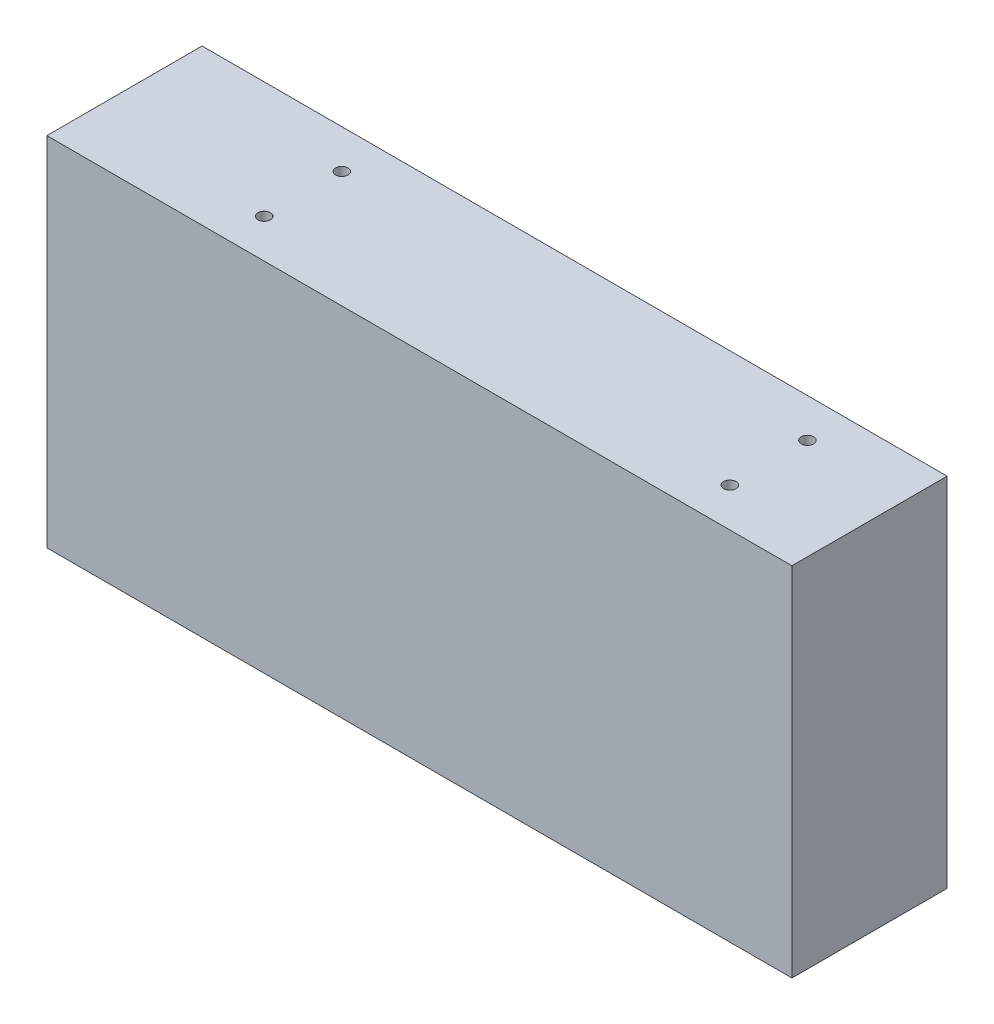
ISO-10303-21;
HEADER;
FILE_DESCRIPTION(('STEP AP214'),'2;1');
FILE_NAME('part.step','',(''),(''),'','','');
FILE_SCHEMA(('AUTOMOTIVE_DESIGN { 1 0 10303 214 1 1 1 1 }'));
ENDSEC;
DATA;
#1=APPLICATION_CONTEXT('core data for automotive mechanical design processes');
#2=APPLICATION_PROTOCOL_DEFINITION('international standard','automotive_design',2000,#1);
#3=PRODUCT_CONTEXT('',#1,'mechanical');
#4=PRODUCT('Part','Part','',(#3));
#5=PRODUCT_RELATED_PRODUCT_CATEGORY('part','',(#4));
#6=PRODUCT_DEFINITION_FORMATION('','',#4);
#7=PRODUCT_DEFINITION_CONTEXT('part definition',#1,'design');
#8=PRODUCT_DEFINITION('design','',#6,#7);
#9=PRODUCT_DEFINITION_SHAPE('','',#8);
#10=(LENGTH_UNIT() NAMED_UNIT(*) SI_UNIT(.MILLI.,.METRE.));
#11=(NAMED_UNIT(*) PLANE_ANGLE_UNIT() SI_UNIT($,.RADIAN.));
#12=(NAMED_UNIT(*) SI_UNIT($,.STERADIAN.) SOLID_ANGLE_UNIT());
#13=UNCERTAINTY_MEASURE_WITH_UNIT(LENGTH_MEASURE(1.E-05),#10,'distance_accuracy_value','');
#14=(GEOMETRIC_REPRESENTATION_CONTEXT(3) GLOBAL_UNCERTAINTY_ASSIGNED_CONTEXT((#13)) GLOBAL_UNIT_ASSIGNED_CONTEXT((#10,
#11,#12)) REPRESENTATION_CONTEXT('',''));
#15=CARTESIAN_POINT('',(0.,0.,0.));
#16=DIRECTION('',(0.,0.,1.));
#17=DIRECTION('',(1.,0.,0.));
#18=AXIS2_PLACEMENT_3D('',#15,#16,#17);
#19=CARTESIAN_POINT('',(-117.057220708447,61.7983651226158,50.));
#20=DIRECTION('',(1.,0.,0.));
#21=DIRECTION('',(0.,0.,-1.));
#22=AXIS2_PLACEMENT_3D('',#19,#20,#21);
#23=PLANE('',#22);
#24=DIRECTION('',(0.,-1.,0.));
#25=VECTOR('',#24,1.);
#26=CARTESIAN_POINT('',(-117.057220708447,61.7983651226158,0.));
#27=LINE('',#26,#25);
#28=CARTESIAN_POINT('',(-117.057220708447,61.7983651226158,0.));
#29=VERTEX_POINT('',#28);
#30=CARTESIAN_POINT('',(-117.057220708447,-53.2016348773842,0.));
#31=VERTEX_POINT('',#30);
#32=EDGE_CURVE('E109',#29,#31,#27,.T.);
#33=ORIENTED_EDGE('',*,*,#32,.T.);
#34=DIRECTION('',(0.,0.,-1.));
#35=VECTOR('',#34,1.);
#36=CARTESIAN_POINT('',(-117.057220708447,-53.2016348773842,50.));
#37=LINE('',#36,#35);
#38=CARTESIAN_POINT('',(-117.057220708447,-53.2016348773842,50.));
#39=VERTEX_POINT('',#38);
#40=EDGE_CURVE('E11',#39,#31,#37,.T.);
#41=ORIENTED_EDGE('',*,*,#40,.F.);
#42=DIRECTION('',(0.,-1.,0.));
#43=VECTOR('',#42,1.);
#44=CARTESIAN_POINT('',(-117.057220708447,61.7983651226158,50.));
#45=LINE('',#44,#43);
#46=CARTESIAN_POINT('',(-117.057220708447,61.7983651226158,50.));
#47=VERTEX_POINT('',#46);
#48=EDGE_CURVE('E93',#47,#39,#45,.T.);
#49=ORIENTED_EDGE('',*,*,#48,.F.);
#50=DIRECTION('',(0.,0.,-1.));
#51=VECTOR('',#50,1.);
#52=CARTESIAN_POINT('',(-117.057220708447,61.7983651226158,50.));
#53=LINE('',#52,#51);
#54=EDGE_CURVE('E105',#47,#29,#53,.T.);
#55=ORIENTED_EDGE('',*,*,#54,.T.);
#56=EDGE_LOOP('',(#33,#41,#49,#55));
#57=FACE_BOUND('',#56,.T.);
#58=ADVANCED_FACE('F41',(#57),#23,.F.);
#59=CARTESIAN_POINT('',(-117.057220708447,-53.2016348773842,50.));
#60=DIRECTION('',(0.,1.,0.));
#61=DIRECTION('',(0.,0.,1.));
#62=AXIS2_PLACEMENT_3D('',#59,#60,#61);
#63=PLANE('',#62);
#64=DIRECTION('',(1.,0.,0.));
#65=VECTOR('',#64,1.);
#66=CARTESIAN_POINT('',(-117.057220708447,-53.2016348773842,0.));
#67=LINE('',#66,#65);
#68=CARTESIAN_POINT('',(122.942779291553,-53.2016348773842,0.));
#69=VERTEX_POINT('',#68);
#70=EDGE_CURVE('E98',#31,#69,#67,.T.);
#71=ORIENTED_EDGE('',*,*,#70,.T.);
#72=DIRECTION('',(0.,0.,-1.));
#73=VECTOR('',#72,1.);
#74=CARTESIAN_POINT('',(122.942779291553,-53.2016348773842,50.));
#75=LINE('',#74,#73);
#76=CARTESIAN_POINT('',(122.942779291553,-53.2016348773842,50.));
#77=VERTEX_POINT('',#76);
#78=EDGE_CURVE('E50',#77,#69,#75,.T.);
#79=ORIENTED_EDGE('',*,*,#78,.F.);
#80=DIRECTION('',(1.,0.,0.));
#81=VECTOR('',#80,1.);
#82=CARTESIAN_POINT('',(-117.057220708447,-53.2016348773842,50.));
#83=LINE('',#82,#81);
#84=EDGE_CURVE('E88',#39,#77,#83,.T.);
#85=ORIENTED_EDGE('',*,*,#84,.F.);
#86=ORIENTED_EDGE('',*,*,#40,.T.);
#87=EDGE_LOOP('',(#71,#79,#85,#86));
#88=FACE_BOUND('',#87,.T.);
#89=ADVANCED_FACE('F97',(#88),#63,.F.);
#90=CARTESIAN_POINT('',(122.942779291553,61.7983651226158,50.));
#91=DIRECTION('',(-1.,0.,0.));
#92=DIRECTION('',(0.,0.,1.));
#93=AXIS2_PLACEMENT_3D('',#90,#91,#92);
#94=PLANE('',#93);
#95=DIRECTION('',(0.,1.,0.));
#96=VECTOR('',#95,1.);
#97=CARTESIAN_POINT('',(122.942779291553,61.7983651226158,0.));
#98=LINE('',#97,#96);
#99=CARTESIAN_POINT('',(122.942779291553,61.7983651226158,0.));
#100=VERTEX_POINT('',#99);
#101=EDGE_CURVE('E75',#69,#100,#98,.T.);
#102=ORIENTED_EDGE('',*,*,#101,.T.);
#103=DIRECTION('',(0.,0.,-1.));
#104=VECTOR('',#103,1.);
#105=CARTESIAN_POINT('',(122.942779291553,61.7983651226158,50.));
#106=LINE('',#105,#104);
#107=CARTESIAN_POINT('',(122.942779291553,61.7983651226158,50.));
#108=VERTEX_POINT('',#107);
#109=EDGE_CURVE('E100',#108,#100,#106,.T.);
#110=ORIENTED_EDGE('',*,*,#109,.F.);
#111=DIRECTION('',(0.,1.,0.));
#112=VECTOR('',#111,1.);
#113=CARTESIAN_POINT('',(122.942779291553,61.7983651226158,50.));
#114=LINE('',#113,#112);
#115=EDGE_CURVE('E91',#77,#108,#114,.T.);
#116=ORIENTED_EDGE('',*,*,#115,.F.);
#117=ORIENTED_EDGE('',*,*,#78,.T.);
#118=EDGE_LOOP('',(#102,#110,#116,#117));
#119=FACE_BOUND('',#118,.T.);
#120=ADVANCED_FACE('F101',(#119),#94,.F.);
#121=CARTESIAN_POINT('',(-117.057220708447,61.7983651226158,50.));
#122=DIRECTION('',(0.,-1.,0.));
#123=DIRECTION('',(0.,0.,-1.));
#124=AXIS2_PLACEMENT_3D('',#121,#122,#123);
#125=PLANE('',#124);
#126=CARTESIAN_POINT('',(90.4427792915531,61.7983651226158,12.5));
#127=DIRECTION('',(0.,1.,0.));
#128=DIRECTION('',(0.,0.,1.));
#129=AXIS2_PLACEMENT_3D('',#126,#127,#128);
#130=CIRCLE('',#129,2.);
#131=CARTESIAN_POINT('',(90.4427792915531,61.7983651226158,14.5));
#132=VERTEX_POINT('',#131);
#133=EDGE_CURVE('E170',#132,#132,#130,.T.);
#134=ORIENTED_EDGE('',*,*,#133,.F.);
#135=EDGE_LOOP('',(#134));
#136=FACE_BOUND('',#135,.T.);
#137=CARTESIAN_POINT('',(-59.5572207084468,61.7983651226158,12.5));
#138=DIRECTION('',(0.,1.,0.));
#139=DIRECTION('',(0.,0.,1.));
#140=AXIS2_PLACEMENT_3D('',#137,#138,#139);
#141=CIRCLE('',#140,2.);
#142=CARTESIAN_POINT('',(-59.5572207084468,61.7983651226158,14.5));
#143=VERTEX_POINT('',#142);
#144=EDGE_CURVE('E178',#143,#143,#141,.T.);
#145=ORIENTED_EDGE('',*,*,#144,.F.);
#146=EDGE_LOOP('',(#145));
#147=FACE_BOUND('',#146,.T.);
#148=CARTESIAN_POINT('',(-59.5572207084468,61.7983651226158,37.5));
#149=DIRECTION('',(0.,1.,0.));
#150=DIRECTION('',(0.,0.,1.));
#151=AXIS2_PLACEMENT_3D('',#148,#149,#150);
#152=CIRCLE('',#151,2.);
#153=CARTESIAN_POINT('',(-59.5572207084468,61.7983651226158,39.5));
#154=VERTEX_POINT('',#153);
#155=EDGE_CURVE('E186',#154,#154,#152,.T.);
#156=ORIENTED_EDGE('',*,*,#155,.F.);
#157=EDGE_LOOP('',(#156));
#158=FACE_BOUND('',#157,.T.);
#159=CARTESIAN_POINT('',(90.4427792915532,61.7983651226158,37.5));
#160=DIRECTION('',(0.,1.,0.));
#161=DIRECTION('',(0.,0.,1.));
#162=AXIS2_PLACEMENT_3D('',#159,#160,#161);
#163=CIRCLE('',#162,2.);
#164=CARTESIAN_POINT('',(90.4427792915532,61.7983651226158,39.5));
#165=VERTEX_POINT('',#164);
#166=EDGE_CURVE('E162',#165,#165,#163,.T.);
#167=ORIENTED_EDGE('',*,*,#166,.F.);
#168=EDGE_LOOP('',(#167));
#169=FACE_BOUND('',#168,.T.);
#170=DIRECTION('',(-1.,0.,0.));
#171=VECTOR('',#170,1.);
#172=CARTESIAN_POINT('',(-117.057220708447,61.7983651226158,0.));
#173=LINE('',#172,#171);
#174=EDGE_CURVE('E81',#100,#29,#173,.T.);
#175=ORIENTED_EDGE('',*,*,#174,.T.);
#176=ORIENTED_EDGE('',*,*,#54,.F.);
#177=DIRECTION('',(-1.,0.,0.));
#178=VECTOR('',#177,1.);
#179=CARTESIAN_POINT('',(-117.057220708447,61.7983651226158,50.));
#180=LINE('',#179,#178);
#181=EDGE_CURVE('E58',#108,#47,#180,.T.);
#182=ORIENTED_EDGE('',*,*,#181,.F.);
#183=ORIENTED_EDGE('',*,*,#109,.T.);
#184=EDGE_LOOP('',(#175,#176,#182,#183));
#185=FACE_BOUND('',#184,.T.);
#186=ADVANCED_FACE('F123',(#136,#147,#158,#169,#185),#125,.F.);
#187=CARTESIAN_POINT('',(0.,0.,50.));
#188=DIRECTION('',(0.,0.,1.));
#189=DIRECTION('',(1.,0.,0.));
#190=AXIS2_PLACEMENT_3D('',#187,#188,#189);
#191=PLANE('',#190);
#192=ORIENTED_EDGE('',*,*,#48,.T.);
#193=ORIENTED_EDGE('',*,*,#84,.T.);
#194=ORIENTED_EDGE('',*,*,#115,.T.);
#195=ORIENTED_EDGE('',*,*,#181,.T.);
#196=EDGE_LOOP('',(#192,#193,#194,#195));
#197=FACE_BOUND('',#196,.T.);
#198=ADVANCED_FACE('F89',(#197),#191,.T.);
#199=CARTESIAN_POINT('',(0.,0.,0.));
#200=DIRECTION('',(0.,0.,1.));
#201=DIRECTION('',(1.,0.,0.));
#202=AXIS2_PLACEMENT_3D('',#199,#200,#201);
#203=PLANE('',#202);
#204=CARTESIAN_POINT('',(90.4427792915531,-20.7016348773842,0.));
#205=DIRECTION('',(0.,0.,-1.));
#206=DIRECTION('',(-1.,0.,0.));
#207=AXIS2_PLACEMENT_3D('',#204,#205,#206);
#208=CIRCLE('',#207,2.);
#209=CARTESIAN_POINT('',(88.4427792915531,-20.7016348773842,0.));
#210=VERTEX_POINT('',#209);
#211=EDGE_CURVE('E138',#210,#210,#208,.T.);
#212=ORIENTED_EDGE('',*,*,#211,.F.);
#213=EDGE_LOOP('',(#212));
#214=FACE_BOUND('',#213,.T.);
#215=CARTESIAN_POINT('',(-59.5572207084468,-20.7016348773842,0.));
#216=DIRECTION('',(0.,0.,-1.));
#217=DIRECTION('',(-1.,0.,0.));
#218=AXIS2_PLACEMENT_3D('',#215,#216,#217);
#219=CIRCLE('',#218,2.);
#220=CARTESIAN_POINT('',(-61.5572207084469,-20.7016348773842,0.));
#221=VERTEX_POINT('',#220);
#222=EDGE_CURVE('E147',#221,#221,#219,.T.);
#223=ORIENTED_EDGE('',*,*,#222,.F.);
#224=EDGE_LOOP('',(#223));
#225=FACE_BOUND('',#224,.T.);
#226=CARTESIAN_POINT('',(-59.5572207084468,29.2983651226158,0.));
#227=DIRECTION('',(0.,0.,-1.));
#228=DIRECTION('',(-1.,0.,0.));
#229=AXIS2_PLACEMENT_3D('',#226,#227,#228);
#230=CIRCLE('',#229,2.);
#231=CARTESIAN_POINT('',(-61.5572207084468,29.2983651226158,0.));
#232=VERTEX_POINT('',#231);
#233=EDGE_CURVE('E155',#232,#232,#230,.T.);
#234=ORIENTED_EDGE('',*,*,#233,.F.);
#235=EDGE_LOOP('',(#234));
#236=FACE_BOUND('',#235,.T.);
#237=CARTESIAN_POINT('',(90.4427792915531,29.2983651226158,0.));
#238=DIRECTION('',(0.,0.,-1.));
#239=DIRECTION('',(-1.,0.,0.));
#240=AXIS2_PLACEMENT_3D('',#237,#238,#239);
#241=CIRCLE('',#240,2.);
#242=CARTESIAN_POINT('',(88.4427792915531,29.2983651226158,0.));
#243=VERTEX_POINT('',#242);
#244=EDGE_CURVE('E130',#243,#243,#241,.T.);
#245=ORIENTED_EDGE('',*,*,#244,.F.);
#246=EDGE_LOOP('',(#245));
#247=FACE_BOUND('',#246,.T.);
#248=ORIENTED_EDGE('',*,*,#32,.F.);
#249=ORIENTED_EDGE('',*,*,#174,.F.);
#250=ORIENTED_EDGE('',*,*,#101,.F.);
#251=ORIENTED_EDGE('',*,*,#70,.F.);
#252=EDGE_LOOP('',(#248,#249,#250,#251));
#253=FACE_BOUND('',#252,.T.);
#254=ADVANCED_FACE('F126',(#214,#225,#236,#247,#253),#203,.F.);
#255=CARTESIAN_POINT('',(90.4427792915531,29.2983651226158,5.));
#256=DIRECTION('',(0.,0.,-1.));
#257=DIRECTION('',(-1.,0.,0.));
#258=AXIS2_PLACEMENT_3D('',#255,#256,#257);
#259=CYLINDRICAL_SURFACE('',#258,2.);
#260=CARTESIAN_POINT('',(90.4427792915531,29.2983651226158,5.));
#261=DIRECTION('',(0.,0.,-1.));
#262=DIRECTION('',(-1.,0.,0.));
#263=AXIS2_PLACEMENT_3D('',#260,#261,#262);
#264=CIRCLE('',#263,2.);
#265=CARTESIAN_POINT('',(88.4427792915531,29.2983651226158,5.));
#266=VERTEX_POINT('',#265);
#267=EDGE_CURVE('E113',#266,#266,#264,.T.);
#268=ORIENTED_EDGE('',*,*,#267,.F.);
#269=EDGE_LOOP('',(#268));
#270=FACE_BOUND('',#269,.T.);
#271=ORIENTED_EDGE('',*,*,#244,.T.);
#272=EDGE_LOOP('',(#271));
#273=FACE_BOUND('',#272,.T.);
#274=ADVANCED_FACE('F236',(#270,#273),#259,.F.);
#275=CARTESIAN_POINT('',(90.4427792915531,29.2983651226158,5.));
#276=DIRECTION('',(0.,0.,-1.));
#277=DIRECTION('',(-1.,0.,0.));
#278=AXIS2_PLACEMENT_3D('',#275,#276,#277);
#279=PLANE('',#278);
#280=ORIENTED_EDGE('',*,*,#267,.T.);
#281=EDGE_LOOP('',(#280));
#282=FACE_BOUND('',#281,.T.);
#283=ADVANCED_FACE('F242',(#282),#279,.T.);
#284=CARTESIAN_POINT('',(-59.5572207084468,29.2983651226158,5.));
#285=DIRECTION('',(0.,0.,-1.));
#286=DIRECTION('',(-1.,0.,0.));
#287=AXIS2_PLACEMENT_3D('',#284,#285,#286);
#288=CYLINDRICAL_SURFACE('',#287,2.);
#289=CARTESIAN_POINT('',(-59.5572207084468,29.2983651226158,5.));
#290=DIRECTION('',(0.,0.,-1.));
#291=DIRECTION('',(-1.,0.,0.));
#292=AXIS2_PLACEMENT_3D('',#289,#290,#291);
#293=CIRCLE('',#292,2.);
#294=CARTESIAN_POINT('',(-61.5572207084468,29.2983651226158,5.));
#295=VERTEX_POINT('',#294);
#296=EDGE_CURVE('E134',#295,#295,#293,.T.);
#297=ORIENTED_EDGE('',*,*,#296,.F.);
#298=EDGE_LOOP('',(#297));
#299=FACE_BOUND('',#298,.T.);
#300=ORIENTED_EDGE('',*,*,#233,.T.);
#301=EDGE_LOOP('',(#300));
#302=FACE_BOUND('',#301,.T.);
#303=ADVANCED_FACE('F246',(#299,#302),#288,.F.);
#304=CARTESIAN_POINT('',(-59.5572207084468,29.2983651226158,5.));
#305=DIRECTION('',(0.,0.,-1.));
#306=DIRECTION('',(-1.,0.,0.));
#307=AXIS2_PLACEMENT_3D('',#304,#305,#306);
#308=PLANE('',#307);
#309=ORIENTED_EDGE('',*,*,#296,.T.);
#310=EDGE_LOOP('',(#309));
#311=FACE_BOUND('',#310,.T.);
#312=ADVANCED_FACE('F255',(#311),#308,.T.);
#313=CARTESIAN_POINT('',(-59.5572207084468,-20.7016348773842,5.));
#314=DIRECTION('',(0.,0.,-1.));
#315=DIRECTION('',(-1.,0.,0.));
#316=AXIS2_PLACEMENT_3D('',#313,#314,#315);
#317=CYLINDRICAL_SURFACE('',#316,2.);
#318=CARTESIAN_POINT('',(-59.5572207084468,-20.7016348773842,5.));
#319=DIRECTION('',(0.,0.,-1.));
#320=DIRECTION('',(-1.,0.,0.));
#321=AXIS2_PLACEMENT_3D('',#318,#319,#320);
#322=CIRCLE('',#321,2.);
#323=CARTESIAN_POINT('',(-61.5572207084469,-20.7016348773842,5.));
#324=VERTEX_POINT('',#323);
#325=EDGE_CURVE('E151',#324,#324,#322,.T.);
#326=ORIENTED_EDGE('',*,*,#325,.F.);
#327=EDGE_LOOP('',(#326));
#328=FACE_BOUND('',#327,.T.);
#329=ORIENTED_EDGE('',*,*,#222,.T.);
#330=EDGE_LOOP('',(#329));
#331=FACE_BOUND('',#330,.T.);
#332=ADVANCED_FACE('F252',(#328,#331),#317,.F.);
#333=CARTESIAN_POINT('',(-59.5572207084468,-20.7016348773842,5.));
#334=DIRECTION('',(0.,0.,-1.));
#335=DIRECTION('',(-1.,0.,0.));
#336=AXIS2_PLACEMENT_3D('',#333,#334,#335);
#337=PLANE('',#336);
#338=ORIENTED_EDGE('',*,*,#325,.T.);
#339=EDGE_LOOP('',(#338));
#340=FACE_BOUND('',#339,.T.);
#341=ADVANCED_FACE('F249',(#340),#337,.T.);
#342=CARTESIAN_POINT('',(90.4427792915531,-20.7016348773842,5.));
#343=DIRECTION('',(0.,0.,-1.));
#344=DIRECTION('',(-1.,0.,0.));
#345=AXIS2_PLACEMENT_3D('',#342,#343,#344);
#346=CYLINDRICAL_SURFACE('',#345,2.);
#347=CARTESIAN_POINT('',(90.4427792915531,-20.7016348773842,5.));
#348=DIRECTION('',(0.,0.,-1.));
#349=DIRECTION('',(-1.,0.,0.));
#350=AXIS2_PLACEMENT_3D('',#347,#348,#349);
#351=CIRCLE('',#350,2.);
#352=CARTESIAN_POINT('',(88.4427792915531,-20.7016348773842,5.));
#353=VERTEX_POINT('',#352);
#354=EDGE_CURVE('E142',#353,#353,#351,.T.);
#355=ORIENTED_EDGE('',*,*,#354,.F.);
#356=EDGE_LOOP('',(#355));
#357=FACE_BOUND('',#356,.T.);
#358=ORIENTED_EDGE('',*,*,#211,.T.);
#359=EDGE_LOOP('',(#358));
#360=FACE_BOUND('',#359,.T.);
#361=ADVANCED_FACE('F220',(#357,#360),#346,.F.);
#362=CARTESIAN_POINT('',(90.4427792915531,-20.7016348773842,5.));
#363=DIRECTION('',(0.,0.,-1.));
#364=DIRECTION('',(-1.,0.,0.));
#365=AXIS2_PLACEMENT_3D('',#362,#363,#364);
#366=PLANE('',#365);
#367=ORIENTED_EDGE('',*,*,#354,.T.);
#368=EDGE_LOOP('',(#367));
#369=FACE_BOUND('',#368,.T.);
#370=ADVANCED_FACE('F211',(#369),#366,.T.);
#371=CARTESIAN_POINT('',(90.4427792915532,55.7983651226158,37.5));
#372=DIRECTION('',(0.,1.,0.));
#373=DIRECTION('',(0.,0.,1.));
#374=AXIS2_PLACEMENT_3D('',#371,#372,#373);
#375=CYLINDRICAL_SURFACE('',#374,2.);
#376=CARTESIAN_POINT('',(90.4427792915532,55.7983651226158,37.5));
#377=DIRECTION('',(0.,1.,0.));
#378=DIRECTION('',(0.,0.,1.));
#379=AXIS2_PLACEMENT_3D('',#376,#377,#378);
#380=CIRCLE('',#379,2.);
#381=CARTESIAN_POINT('',(90.4427792915532,55.7983651226158,39.5));
#382=VERTEX_POINT('',#381);
#383=EDGE_CURVE('E143',#382,#382,#380,.T.);
#384=ORIENTED_EDGE('',*,*,#383,.F.);
#385=EDGE_LOOP('',(#384));
#386=FACE_BOUND('',#385,.T.);
#387=ORIENTED_EDGE('',*,*,#166,.T.);
#388=EDGE_LOOP('',(#387));
#389=FACE_BOUND('',#388,.T.);
#390=ADVANCED_FACE('F209',(#386,#389),#375,.F.);
#391=CARTESIAN_POINT('',(90.4427792915532,55.7983651226158,37.5));
#392=DIRECTION('',(0.,1.,0.));
#393=DIRECTION('',(0.,0.,1.));
#394=AXIS2_PLACEMENT_3D('',#391,#392,#393);
#395=PLANE('',#394);
#396=ORIENTED_EDGE('',*,*,#383,.T.);
#397=EDGE_LOOP('',(#396));
#398=FACE_BOUND('',#397,.T.);
#399=ADVANCED_FACE('F199',(#398),#395,.T.);
#400=CARTESIAN_POINT('',(-59.5572207084468,55.7983651226158,37.5));
#401=DIRECTION('',(0.,1.,0.));
#402=DIRECTION('',(0.,0.,1.));
#403=AXIS2_PLACEMENT_3D('',#400,#401,#402);
#404=CYLINDRICAL_SURFACE('',#403,2.);
#405=CARTESIAN_POINT('',(-59.5572207084468,55.7983651226158,37.5));
#406=DIRECTION('',(0.,1.,0.));
#407=DIRECTION('',(0.,0.,1.));
#408=AXIS2_PLACEMENT_3D('',#405,#406,#407);
#409=CIRCLE('',#408,2.);
#410=CARTESIAN_POINT('',(-59.5572207084468,55.7983651226158,39.5));
#411=VERTEX_POINT('',#410);
#412=EDGE_CURVE('E166',#411,#411,#409,.T.);
#413=ORIENTED_EDGE('',*,*,#412,.F.);
#414=EDGE_LOOP('',(#413));
#415=FACE_BOUND('',#414,.T.);
#416=ORIENTED_EDGE('',*,*,#155,.T.);
#417=EDGE_LOOP('',(#416));
#418=FACE_BOUND('',#417,.T.);
#419=ADVANCED_FACE('F196',(#415,#418),#404,.F.);
#420=CARTESIAN_POINT('',(-59.5572207084468,55.7983651226158,37.5));
#421=DIRECTION('',(0.,1.,0.));
#422=DIRECTION('',(0.,0.,1.));
#423=AXIS2_PLACEMENT_3D('',#420,#421,#422);
#424=PLANE('',#423);
#425=ORIENTED_EDGE('',*,*,#412,.T.);
#426=EDGE_LOOP('',(#425));
#427=FACE_BOUND('',#426,.T.);
#428=ADVANCED_FACE('F194',(#427),#424,.T.);
#429=CARTESIAN_POINT('',(-59.5572207084468,55.7983651226158,12.5));
#430=DIRECTION('',(0.,1.,0.));
#431=DIRECTION('',(0.,0.,1.));
#432=AXIS2_PLACEMENT_3D('',#429,#430,#431);
#433=CYLINDRICAL_SURFACE('',#432,2.);
#434=CARTESIAN_POINT('',(-59.5572207084468,55.7983651226158,12.5));
#435=DIRECTION('',(0.,1.,0.));
#436=DIRECTION('',(0.,0.,1.));
#437=AXIS2_PLACEMENT_3D('',#434,#435,#436);
#438=CIRCLE('',#437,2.);
#439=CARTESIAN_POINT('',(-59.5572207084468,55.7983651226158,14.5));
#440=VERTEX_POINT('',#439);
#441=EDGE_CURVE('E182',#440,#440,#438,.T.);
#442=ORIENTED_EDGE('',*,*,#441,.F.);
#443=EDGE_LOOP('',(#442));
#444=FACE_BOUND('',#443,.T.);
#445=ORIENTED_EDGE('',*,*,#144,.T.);
#446=EDGE_LOOP('',(#445));
#447=FACE_BOUND('',#446,.T.);
#448=ADVANCED_FACE('F326',(#444,#447),#433,.F.);
#449=CARTESIAN_POINT('',(-59.5572207084468,55.7983651226158,12.5));
#450=DIRECTION('',(0.,1.,0.));
#451=DIRECTION('',(0.,0.,1.));
#452=AXIS2_PLACEMENT_3D('',#449,#450,#451);
#453=PLANE('',#452);
#454=ORIENTED_EDGE('',*,*,#441,.T.);
#455=EDGE_LOOP('',(#454));
#456=FACE_BOUND('',#455,.T.);
#457=ADVANCED_FACE('F335',(#456),#453,.T.);
#458=CARTESIAN_POINT('',(90.4427792915531,55.7983651226158,12.5));
#459=DIRECTION('',(0.,1.,0.));
#460=DIRECTION('',(0.,0.,1.));
#461=AXIS2_PLACEMENT_3D('',#458,#459,#460);
#462=CYLINDRICAL_SURFACE('',#461,2.);
#463=CARTESIAN_POINT('',(90.4427792915531,55.7983651226158,12.5));
#464=DIRECTION('',(0.,1.,0.));
#465=DIRECTION('',(0.,0.,1.));
#466=AXIS2_PLACEMENT_3D('',#463,#464,#465);
#467=CIRCLE('',#466,2.);
#468=CARTESIAN_POINT('',(90.4427792915531,55.7983651226158,14.5));
#469=VERTEX_POINT('',#468);
#470=EDGE_CURVE('E174',#469,#469,#467,.T.);
#471=ORIENTED_EDGE('',*,*,#470,.F.);
#472=EDGE_LOOP('',(#471));
#473=FACE_BOUND('',#472,.T.);
#474=ORIENTED_EDGE('',*,*,#133,.T.);
#475=EDGE_LOOP('',(#474));
#476=FACE_BOUND('',#475,.T.);
#477=ADVANCED_FACE('F345',(#473,#476),#462,.F.);
#478=CARTESIAN_POINT('',(90.4427792915531,55.7983651226158,12.5));
#479=DIRECTION('',(0.,1.,0.));
#480=DIRECTION('',(0.,0.,1.));
#481=AXIS2_PLACEMENT_3D('',#478,#479,#480);
#482=PLANE('',#481);
#483=ORIENTED_EDGE('',*,*,#470,.T.);
#484=EDGE_LOOP('',(#483));
#485=FACE_BOUND('',#484,.T.);
#486=ADVANCED_FACE('F355',(#485),#482,.T.);
#487=CLOSED_SHELL('',(#58,#89,#120,#186,#198,#254,#274,#283,#303,#312,#332,#341,#361,#370,#390,
#399,#419,#428,#448,#457,#477,#486));
#488=MANIFOLD_SOLID_BREP('B2',#487);
#489=ADVANCED_BREP_SHAPE_REPRESENTATION('',(#18,#488),#14);
#490=SHAPE_DEFINITION_REPRESENTATION(#9,#489);
ENDSEC;
END-ISO-10303-21;
